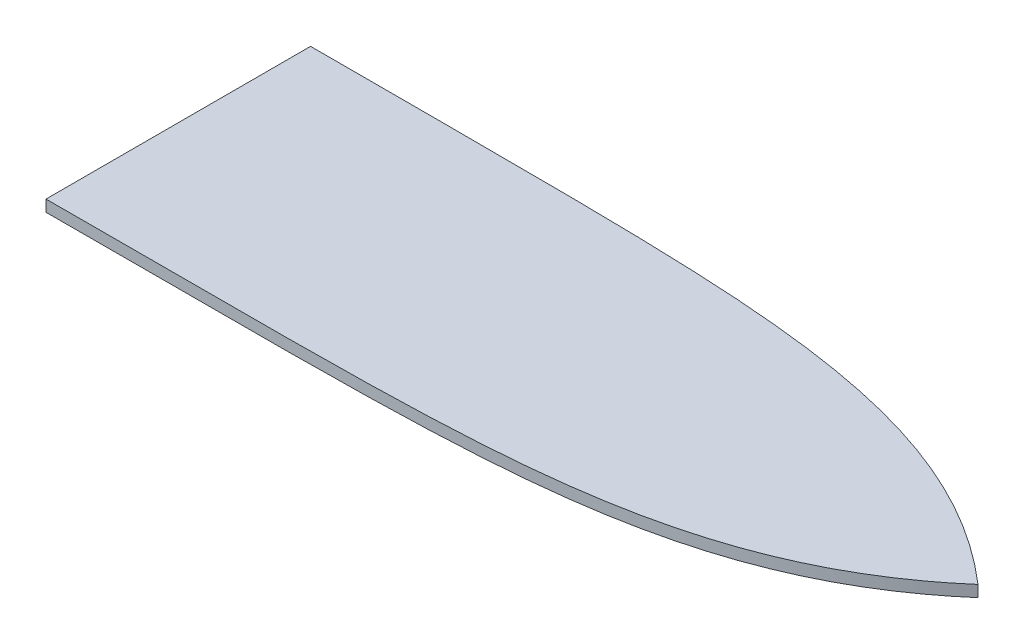
ISO-10303-21;
HEADER;
FILE_DESCRIPTION(('STEP AP214'),'2;1');
FILE_NAME('part.step','',(''),(''),'','','');
FILE_SCHEMA(('AUTOMOTIVE_DESIGN { 1 0 10303 214 1 1 1 1 }'));
ENDSEC;
DATA;
#1=APPLICATION_CONTEXT('core data for automotive mechanical design processes');
#2=APPLICATION_PROTOCOL_DEFINITION('international standard','automotive_design',2000,#1);
#3=PRODUCT_CONTEXT('',#1,'mechanical');
#4=PRODUCT('Part','Part','',(#3));
#5=PRODUCT_RELATED_PRODUCT_CATEGORY('part','',(#4));
#6=PRODUCT_DEFINITION_FORMATION('','',#4);
#7=PRODUCT_DEFINITION_CONTEXT('part definition',#1,'design');
#8=PRODUCT_DEFINITION('design','',#6,#7);
#9=PRODUCT_DEFINITION_SHAPE('','',#8);
#10=(LENGTH_UNIT() NAMED_UNIT(*) SI_UNIT(.MILLI.,.METRE.));
#11=(NAMED_UNIT(*) PLANE_ANGLE_UNIT() SI_UNIT($,.RADIAN.));
#12=(NAMED_UNIT(*) SI_UNIT($,.STERADIAN.) SOLID_ANGLE_UNIT());
#13=UNCERTAINTY_MEASURE_WITH_UNIT(LENGTH_MEASURE(1.E-05),#10,'distance_accuracy_value','');
#14=(GEOMETRIC_REPRESENTATION_CONTEXT(3) GLOBAL_UNCERTAINTY_ASSIGNED_CONTEXT((#13)) GLOBAL_UNIT_ASSIGNED_CONTEXT((#10,
#11,#12)) REPRESENTATION_CONTEXT('',''));
#15=CARTESIAN_POINT('',(0.,0.,0.));
#16=DIRECTION('',(0.,0.,1.));
#17=DIRECTION('',(1.,0.,0.));
#18=AXIS2_PLACEMENT_3D('',#15,#16,#17);
#19=CARTESIAN_POINT('',(3139.26827334746,1146.63157847919,146.348282725462));
#20=CARTESIAN_POINT('',(3318.28667634897,1146.63157847919,146.348282725462));
#21=CARTESIAN_POINT('',(3497.30507935048,1146.63157847919,146.348282725462));
#22=CARTESIAN_POINT('',(3676.32348235199,1146.63157847919,146.348282725462));
#23=CARTESIAN_POINT('',(3855.3418853535,1146.63157847919,146.348282725462));
#24=CARTESIAN_POINT('',(4023.95027334746,1146.63157847919,0.0213547819710433));
#25=B_SPLINE_CURVE_WITH_KNOTS('',5,(#19,#20,#21,#22,#23,#24),.UNSPECIFIED.,.F.,.F.,(6,6),(0.,
9710.49137354744),.UNSPECIFIED.);
#26=DIRECTION('',(0.,-1.,0.));
#27=VECTOR('',#26,1.);
#28=SURFACE_OF_LINEAR_EXTRUSION('',#25,#27);
#29=CARTESIAN_POINT('',(3139.26827334746,1133.93157847919,146.348282725462));
#30=CARTESIAN_POINT('',(3318.28667634897,1133.93157847919,146.348282725462));
#31=CARTESIAN_POINT('',(3497.30507935048,1133.93157847919,146.348282725462));
#32=CARTESIAN_POINT('',(3676.32348235199,1133.93157847919,146.348282725462));
#33=CARTESIAN_POINT('',(3855.3418853535,1133.93157847919,146.348282725462));
#34=CARTESIAN_POINT('',(4023.95027334746,1133.93157847919,0.0213547819710433));
#35=B_SPLINE_CURVE_WITH_KNOTS('',5,(#29,#30,#31,#32,#33,#34),.UNSPECIFIED.,.F.,.F.,(6,6),(0.,
9710.49137354744),.UNSPECIFIED.);
#36=CARTESIAN_POINT('',(3139.26827334746,1133.93157847919,146.348282725462));
#37=VERTEX_POINT('',#36);
#38=CARTESIAN_POINT('',(4023.95027334746,1133.93157847919,0.0213547819710433));
#39=VERTEX_POINT('',#38);
#40=EDGE_CURVE('E80',#37,#39,#35,.T.);
#41=ORIENTED_EDGE('',*,*,#40,.T.);
#42=DIRECTION('',(0.,-1.,0.));
#43=VECTOR('',#42,1.);
#44=CARTESIAN_POINT('',(4023.95027334746,1146.63157847919,0.0213547819710433));
#45=LINE('',#44,#43);
#46=CARTESIAN_POINT('',(4023.95027334746,1146.63157847919,0.0213547819710433));
#47=VERTEX_POINT('',#46);
#48=EDGE_CURVE('E11',#47,#39,#45,.T.);
#49=ORIENTED_EDGE('',*,*,#48,.F.);
#50=CARTESIAN_POINT('',(3139.26827334746,1146.63157847919,146.348282725462));
#51=VERTEX_POINT('',#50);
#52=EDGE_CURVE('E74',#51,#47,#25,.T.);
#53=ORIENTED_EDGE('',*,*,#52,.F.);
#54=DIRECTION('',(0.,-1.,0.));
#55=VECTOR('',#54,1.);
#56=CARTESIAN_POINT('',(3139.26827334746,1146.63157847919,146.348282725462));
#57=LINE('',#56,#55);
#58=EDGE_CURVE('E81',#51,#37,#57,.T.);
#59=ORIENTED_EDGE('',*,*,#58,.T.);
#60=EDGE_LOOP('',(#41,#49,#53,#59));
#61=FACE_BOUND('',#60,.T.);
#62=ADVANCED_FACE('F33',(#61),#28,.F.);
#63=CARTESIAN_POINT('',(4023.95027334746,1146.63157847919,0.0213547819710433));
#64=CARTESIAN_POINT('',(3855.3418853535,1146.63157847919,-146.30557316152));
#65=CARTESIAN_POINT('',(3676.32348235199,1146.63157847919,-146.30557316152));
#66=CARTESIAN_POINT('',(3497.30507935048,1146.63157847919,-146.30557316152));
#67=CARTESIAN_POINT('',(3318.28667634897,1146.63157847919,-146.30557316152));
#68=CARTESIAN_POINT('',(3139.26827334746,1146.63157847919,-146.30557316152));
#69=B_SPLINE_CURVE_WITH_KNOTS('',5,(#63,#64,#65,#66,#67,#68),.UNSPECIFIED.,.F.,.F.,(6,6),(0.,
9710.49137354744),.UNSPECIFIED.);
#70=DIRECTION('',(0.,-1.,0.));
#71=VECTOR('',#70,1.);
#72=SURFACE_OF_LINEAR_EXTRUSION('',#69,#71);
#73=CARTESIAN_POINT('',(4023.95027334746,1133.93157847919,0.0213547819710433));
#74=CARTESIAN_POINT('',(3855.3418853535,1133.93157847919,-146.30557316152));
#75=CARTESIAN_POINT('',(3676.32348235199,1133.93157847919,-146.30557316152));
#76=CARTESIAN_POINT('',(3497.30507935048,1133.93157847919,-146.30557316152));
#77=CARTESIAN_POINT('',(3318.28667634897,1133.93157847919,-146.30557316152));
#78=CARTESIAN_POINT('',(3139.26827334746,1133.93157847919,-146.30557316152));
#79=B_SPLINE_CURVE_WITH_KNOTS('',5,(#73,#74,#75,#76,#77,#78),.UNSPECIFIED.,.F.,.F.,(6,6),(0.,
9710.49137354744),.UNSPECIFIED.);
#80=CARTESIAN_POINT('',(3139.26827334746,1133.93157847919,-146.30557316152));
#81=VERTEX_POINT('',#80);
#82=EDGE_CURVE('E62',#39,#81,#79,.T.);
#83=ORIENTED_EDGE('',*,*,#82,.T.);
#84=DIRECTION('',(0.,-1.,0.));
#85=VECTOR('',#84,1.);
#86=CARTESIAN_POINT('',(3139.26827334746,1146.63157847919,-146.30557316152));
#87=LINE('',#86,#85);
#88=CARTESIAN_POINT('',(3139.26827334746,1146.63157847919,-146.30557316152));
#89=VERTEX_POINT('',#88);
#90=EDGE_CURVE('E42',#89,#81,#87,.T.);
#91=ORIENTED_EDGE('',*,*,#90,.F.);
#92=EDGE_CURVE('E70',#47,#89,#69,.T.);
#93=ORIENTED_EDGE('',*,*,#92,.F.);
#94=ORIENTED_EDGE('',*,*,#48,.T.);
#95=EDGE_LOOP('',(#83,#91,#93,#94));
#96=FACE_BOUND('',#95,.T.);
#97=ADVANCED_FACE('F71',(#96),#72,.F.);
#98=CARTESIAN_POINT('',(3139.26827334746,1146.63157847919,-146.30557316152));
#99=DIRECTION('',(1.,0.,0.));
#100=DIRECTION('',(0.,0.,-1.));
#101=AXIS2_PLACEMENT_3D('',#98,#99,#100);
#102=PLANE('',#101);
#103=DIRECTION('',(0.,0.,1.));
#104=VECTOR('',#103,1.);
#105=CARTESIAN_POINT('',(3139.26827334746,1133.93157847919,-146.30557316152));
#106=LINE('',#105,#104);
#107=EDGE_CURVE('E67',#81,#37,#106,.T.);
#108=ORIENTED_EDGE('',*,*,#107,.T.);
#109=ORIENTED_EDGE('',*,*,#58,.F.);
#110=DIRECTION('',(0.,0.,1.));
#111=VECTOR('',#110,1.);
#112=CARTESIAN_POINT('',(3139.26827334746,1146.63157847919,-146.30557316152));
#113=LINE('',#112,#111);
#114=EDGE_CURVE('E50',#89,#51,#113,.T.);
#115=ORIENTED_EDGE('',*,*,#114,.F.);
#116=ORIENTED_EDGE('',*,*,#90,.T.);
#117=EDGE_LOOP('',(#108,#109,#115,#116));
#118=FACE_BOUND('',#117,.T.);
#119=ADVANCED_FACE('F98',(#118),#102,.F.);
#120=CARTESIAN_POINT('',(3586.48896788225,1146.63157847919,141.775566227228));
#121=DIRECTION('',(0.,-1.,0.));
#122=DIRECTION('',(0.,0.,-1.));
#123=AXIS2_PLACEMENT_3D('',#120,#121,#122);
#124=PLANE('',#123);
#125=ORIENTED_EDGE('',*,*,#52,.T.);
#126=ORIENTED_EDGE('',*,*,#92,.T.);
#127=ORIENTED_EDGE('',*,*,#114,.T.);
#128=EDGE_LOOP('',(#125,#126,#127));
#129=FACE_BOUND('',#128,.T.);
#130=ADVANCED_FACE('F77',(#129),#124,.F.);
#131=CARTESIAN_POINT('',(3586.48896788225,1133.93157847919,141.775566227228));
#132=DIRECTION('',(0.,-1.,0.));
#133=DIRECTION('',(0.,0.,-1.));
#134=AXIS2_PLACEMENT_3D('',#131,#132,#133);
#135=PLANE('',#134);
#136=ORIENTED_EDGE('',*,*,#40,.F.);
#137=ORIENTED_EDGE('',*,*,#107,.F.);
#138=ORIENTED_EDGE('',*,*,#82,.F.);
#139=EDGE_LOOP('',(#136,#137,#138));
#140=FACE_BOUND('',#139,.T.);
#141=ADVANCED_FACE('F99',(#140),#135,.T.);
#142=CLOSED_SHELL('',(#62,#97,#119,#130,#141));
#143=MANIFOLD_SOLID_BREP('B2',#142);
#144=ADVANCED_BREP_SHAPE_REPRESENTATION('',(#18,#143),#14);
#145=SHAPE_DEFINITION_REPRESENTATION(#9,#144);
ENDSEC;
END-ISO-10303-21;
